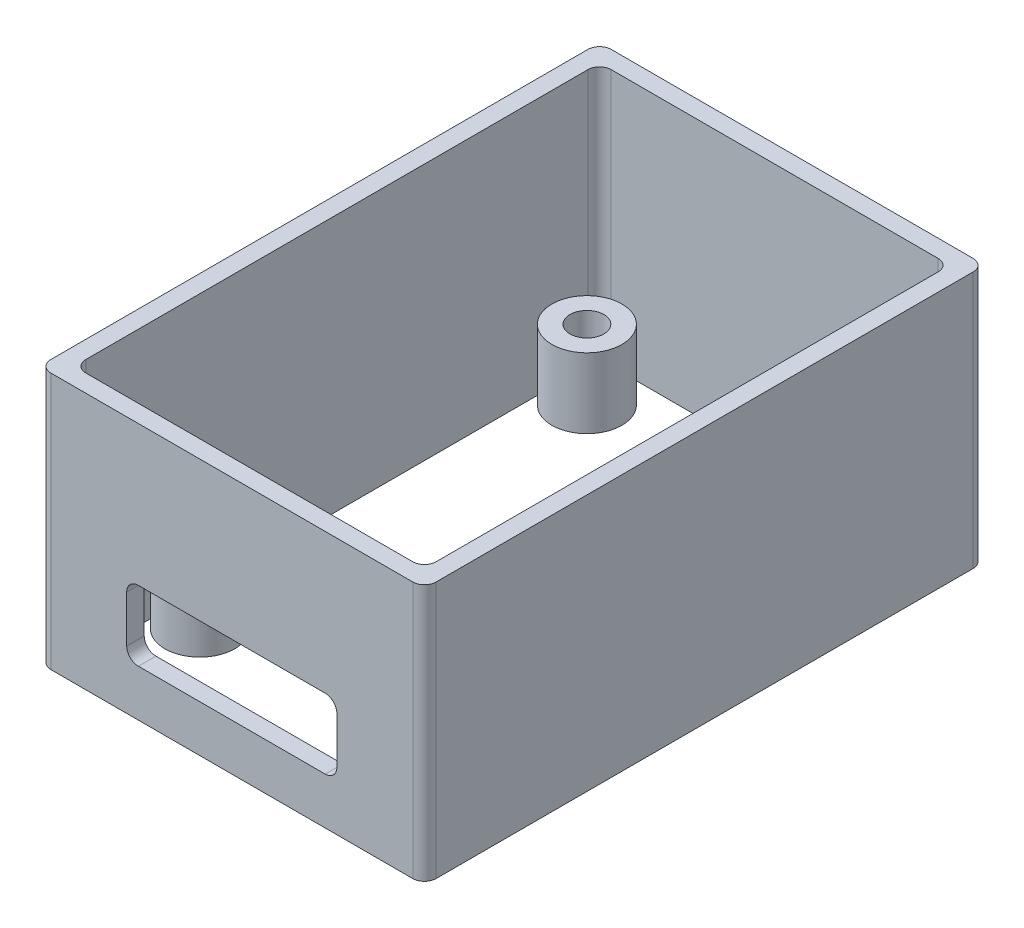
ISO-10303-21;
HEADER;
FILE_DESCRIPTION(('STEP AP214'),'2;1');
FILE_NAME('part.step','',(''),(''),'','','');
FILE_SCHEMA(('AUTOMOTIVE_DESIGN { 1 0 10303 214 1 1 1 1 }'));
ENDSEC;
DATA;
#1=APPLICATION_CONTEXT('core data for automotive mechanical design processes');
#2=APPLICATION_PROTOCOL_DEFINITION('international standard','automotive_design',2000,#1);
#3=PRODUCT_CONTEXT('',#1,'mechanical');
#4=PRODUCT('Part','Part','',(#3));
#5=PRODUCT_RELATED_PRODUCT_CATEGORY('part','',(#4));
#6=PRODUCT_DEFINITION_FORMATION('','',#4);
#7=PRODUCT_DEFINITION_CONTEXT('part definition',#1,'design');
#8=PRODUCT_DEFINITION('design','',#6,#7);
#9=PRODUCT_DEFINITION_SHAPE('','',#8);
#10=(LENGTH_UNIT() NAMED_UNIT(*) SI_UNIT(.MILLI.,.METRE.));
#11=(NAMED_UNIT(*) PLANE_ANGLE_UNIT() SI_UNIT($,.RADIAN.));
#12=(NAMED_UNIT(*) SI_UNIT($,.STERADIAN.) SOLID_ANGLE_UNIT());
#13=UNCERTAINTY_MEASURE_WITH_UNIT(LENGTH_MEASURE(1.E-05),#10,'distance_accuracy_value','');
#14=(GEOMETRIC_REPRESENTATION_CONTEXT(3) GLOBAL_UNCERTAINTY_ASSIGNED_CONTEXT((#13)) GLOBAL_UNIT_ASSIGNED_CONTEXT((#10,
#11,#12)) REPRESENTATION_CONTEXT('',''));
#15=CARTESIAN_POINT('',(0.,0.,0.));
#16=DIRECTION('',(0.,0.,1.));
#17=DIRECTION('',(1.,0.,0.));
#18=AXIS2_PLACEMENT_3D('',#15,#16,#17);
#19=CARTESIAN_POINT('',(-10.16,8.,16.575));
#20=DIRECTION('',(0.,-1.,0.));
#21=DIRECTION('',(0.,0.,-1.));
#22=AXIS2_PLACEMENT_3D('',#19,#20,#21);
#23=CYLINDRICAL_SURFACE('',#22,3.);
#24=CARTESIAN_POINT('',(-10.16,8.,16.575));
#25=DIRECTION('',(0.,1.,0.));
#26=DIRECTION('',(0.,0.,1.));
#27=AXIS2_PLACEMENT_3D('',#24,#25,#26);
#28=CIRCLE('',#27,3.);
#29=CARTESIAN_POINT('',(-10.16,8.,19.575));
#30=VERTEX_POINT('',#29);
#31=EDGE_CURVE('E11',#30,#30,#28,.T.);
#32=ORIENTED_EDGE('',*,*,#31,.F.);
#33=EDGE_LOOP('',(#32));
#34=FACE_BOUND('',#33,.T.);
#35=CARTESIAN_POINT('',(-10.16,2.,16.575));
#36=DIRECTION('',(0.,1.,0.));
#37=DIRECTION('',(0.,0.,1.));
#38=AXIS2_PLACEMENT_3D('',#35,#36,#37);
#39=CIRCLE('',#38,3.);
#40=CARTESIAN_POINT('',(-10.16,2.,19.575));
#41=VERTEX_POINT('',#40);
#42=EDGE_CURVE('E49',#41,#41,#39,.T.);
#43=ORIENTED_EDGE('',*,*,#42,.T.);
#44=EDGE_LOOP('',(#43));
#45=FACE_BOUND('',#44,.T.);
#46=ADVANCED_FACE('F42',(#34,#45),#23,.T.);
#47=CARTESIAN_POINT('',(-10.16,8.,16.575));
#48=DIRECTION('',(0.,1.,0.));
#49=DIRECTION('',(0.,0.,1.));
#50=AXIS2_PLACEMENT_3D('',#47,#48,#49);
#51=PLANE('',#50);
#52=CARTESIAN_POINT('',(-10.16,8.,16.575));
#53=DIRECTION('',(0.,1.,0.));
#54=DIRECTION('',(0.,0.,1.));
#55=AXIS2_PLACEMENT_3D('',#52,#53,#54);
#56=CIRCLE('',#55,1.45);
#57=CARTESIAN_POINT('',(-10.16,8.,18.025));
#58=VERTEX_POINT('',#57);
#59=EDGE_CURVE('E45',#58,#58,#56,.T.);
#60=ORIENTED_EDGE('',*,*,#59,.F.);
#61=EDGE_LOOP('',(#60));
#62=FACE_BOUND('',#61,.T.);
#63=ORIENTED_EDGE('',*,*,#31,.T.);
#64=EDGE_LOOP('',(#63));
#65=FACE_BOUND('',#64,.T.);
#66=ADVANCED_FACE('F65',(#62,#65),#51,.T.);
#67=CARTESIAN_POINT('',(-10.16,2.,16.575));
#68=DIRECTION('',(0.,1.,0.));
#69=DIRECTION('',(0.,0.,1.));
#70=AXIS2_PLACEMENT_3D('',#67,#68,#69);
#71=PLANE('',#70);
#72=CARTESIAN_POINT('',(-10.16,2.,16.575));
#73=DIRECTION('',(0.,1.,0.));
#74=DIRECTION('',(0.,0.,1.));
#75=AXIS2_PLACEMENT_3D('',#72,#73,#74);
#76=CIRCLE('',#75,1.45);
#77=CARTESIAN_POINT('',(-10.16,2.,18.025));
#78=VERTEX_POINT('',#77);
#79=EDGE_CURVE('E54',#78,#78,#76,.T.);
#80=ORIENTED_EDGE('',*,*,#79,.T.);
#81=EDGE_LOOP('',(#80));
#82=FACE_BOUND('',#81,.T.);
#83=ORIENTED_EDGE('',*,*,#42,.F.);
#84=EDGE_LOOP('',(#83));
#85=FACE_BOUND('',#84,.T.);
#86=ADVANCED_FACE('F67',(#82,#85),#71,.F.);
#87=CARTESIAN_POINT('',(-10.16,0.,16.575));
#88=DIRECTION('',(0.,-1.,0.));
#89=DIRECTION('',(0.,0.,-1.));
#90=AXIS2_PLACEMENT_3D('',#87,#88,#89);
#91=CYLINDRICAL_SURFACE('',#90,1.45);
#92=ORIENTED_EDGE('',*,*,#59,.T.);
#93=EDGE_LOOP('',(#92));
#94=FACE_BOUND('',#93,.T.);
#95=ORIENTED_EDGE('',*,*,#79,.F.);
#96=EDGE_LOOP('',(#95));
#97=FACE_BOUND('',#96,.T.);
#98=ADVANCED_FACE('F62',(#94,#97),#91,.F.);
#99=CLOSED_SHELL('',(#46,#66,#86,#98));
#100=MANIFOLD_SOLID_BREP('B2',#99);
#101=CARTESIAN_POINT('',(10.16,8.,-16.575));
#102=DIRECTION('',(0.,-1.,0.));
#103=DIRECTION('',(0.,0.,-1.));
#104=AXIS2_PLACEMENT_3D('',#101,#102,#103);
#105=CYLINDRICAL_SURFACE('',#104,3.);
#106=CARTESIAN_POINT('',(10.16,8.,-16.575));
#107=DIRECTION('',(0.,1.,0.));
#108=DIRECTION('',(0.,0.,1.));
#109=AXIS2_PLACEMENT_3D('',#106,#107,#108);
#110=CIRCLE('',#109,3.);
#111=CARTESIAN_POINT('',(10.16,8.,-13.575));
#112=VERTEX_POINT('',#111);
#113=EDGE_CURVE('E41',#112,#112,#110,.T.);
#114=ORIENTED_EDGE('',*,*,#113,.F.);
#115=EDGE_LOOP('',(#114));
#116=FACE_BOUND('',#115,.T.);
#117=CARTESIAN_POINT('',(10.16,2.,-16.575));
#118=DIRECTION('',(0.,1.,0.));
#119=DIRECTION('',(0.,0.,1.));
#120=AXIS2_PLACEMENT_3D('',#117,#118,#119);
#121=CIRCLE('',#120,3.);
#122=CARTESIAN_POINT('',(10.16,2.,-13.575));
#123=VERTEX_POINT('',#122);
#124=EDGE_CURVE('E119',#123,#123,#121,.T.);
#125=ORIENTED_EDGE('',*,*,#124,.T.);
#126=EDGE_LOOP('',(#125));
#127=FACE_BOUND('',#126,.T.);
#128=ADVANCED_FACE('F112',(#116,#127),#105,.T.);
#129=CARTESIAN_POINT('',(10.16,8.,-16.575));
#130=DIRECTION('',(0.,1.,0.));
#131=DIRECTION('',(0.,0.,1.));
#132=AXIS2_PLACEMENT_3D('',#129,#130,#131);
#133=PLANE('',#132);
#134=CARTESIAN_POINT('',(10.16,8.,-16.575));
#135=DIRECTION('',(0.,1.,0.));
#136=DIRECTION('',(0.,0.,1.));
#137=AXIS2_PLACEMENT_3D('',#134,#135,#136);
#138=CIRCLE('',#137,1.45);
#139=CARTESIAN_POINT('',(10.16,8.,-15.125));
#140=VERTEX_POINT('',#139);
#141=EDGE_CURVE('E124',#140,#140,#138,.T.);
#142=ORIENTED_EDGE('',*,*,#141,.F.);
#143=EDGE_LOOP('',(#142));
#144=FACE_BOUND('',#143,.T.);
#145=ORIENTED_EDGE('',*,*,#113,.T.);
#146=EDGE_LOOP('',(#145));
#147=FACE_BOUND('',#146,.T.);
#148=ADVANCED_FACE('F141',(#144,#147),#133,.T.);
#149=CARTESIAN_POINT('',(10.16,2.,-16.575));
#150=DIRECTION('',(0.,1.,0.));
#151=DIRECTION('',(0.,0.,1.));
#152=AXIS2_PLACEMENT_3D('',#149,#150,#151);
#153=PLANE('',#152);
#154=CARTESIAN_POINT('',(10.16,2.,-16.575));
#155=DIRECTION('',(0.,1.,0.));
#156=DIRECTION('',(0.,0.,1.));
#157=AXIS2_PLACEMENT_3D('',#154,#155,#156);
#158=CIRCLE('',#157,1.45);
#159=CARTESIAN_POINT('',(10.16,2.,-15.125));
#160=VERTEX_POINT('',#159);
#161=EDGE_CURVE('E115',#160,#160,#158,.T.);
#162=ORIENTED_EDGE('',*,*,#161,.T.);
#163=EDGE_LOOP('',(#162));
#164=FACE_BOUND('',#163,.T.);
#165=ORIENTED_EDGE('',*,*,#124,.F.);
#166=EDGE_LOOP('',(#165));
#167=FACE_BOUND('',#166,.T.);
#168=ADVANCED_FACE('F132',(#164,#167),#153,.F.);
#169=CARTESIAN_POINT('',(10.16,0.,-16.575));
#170=DIRECTION('',(0.,-1.,0.));
#171=DIRECTION('',(0.,0.,-1.));
#172=AXIS2_PLACEMENT_3D('',#169,#170,#171);
#173=CYLINDRICAL_SURFACE('',#172,1.45);
#174=ORIENTED_EDGE('',*,*,#141,.T.);
#175=EDGE_LOOP('',(#174));
#176=FACE_BOUND('',#175,.T.);
#177=ORIENTED_EDGE('',*,*,#161,.F.);
#178=EDGE_LOOP('',(#177));
#179=FACE_BOUND('',#178,.T.);
#180=ADVANCED_FACE('F135',(#176,#179),#173,.F.);
#181=CLOSED_SHELL('',(#128,#148,#168,#180));
#182=MANIFOLD_SOLID_BREP('B6',#181);
#183=CARTESIAN_POINT('',(10.16,8.,16.575));
#184=DIRECTION('',(0.,-1.,0.));
#185=DIRECTION('',(0.,0.,-1.));
#186=AXIS2_PLACEMENT_3D('',#183,#184,#185);
#187=CYLINDRICAL_SURFACE('',#186,3.);
#188=CARTESIAN_POINT('',(10.16,8.,16.575));
#189=DIRECTION('',(0.,1.,0.));
#190=DIRECTION('',(0.,0.,1.));
#191=AXIS2_PLACEMENT_3D('',#188,#189,#190);
#192=CIRCLE('',#191,3.);
#193=CARTESIAN_POINT('',(10.16,8.,19.575));
#194=VERTEX_POINT('',#193);
#195=EDGE_CURVE('E111',#194,#194,#192,.T.);
#196=ORIENTED_EDGE('',*,*,#195,.F.);
#197=EDGE_LOOP('',(#196));
#198=FACE_BOUND('',#197,.T.);
#199=CARTESIAN_POINT('',(10.16,2.,16.575));
#200=DIRECTION('',(0.,1.,0.));
#201=DIRECTION('',(0.,0.,1.));
#202=AXIS2_PLACEMENT_3D('',#199,#200,#201);
#203=CIRCLE('',#202,3.);
#204=CARTESIAN_POINT('',(10.16,2.,19.575));
#205=VERTEX_POINT('',#204);
#206=EDGE_CURVE('E189',#205,#205,#203,.T.);
#207=ORIENTED_EDGE('',*,*,#206,.T.);
#208=EDGE_LOOP('',(#207));
#209=FACE_BOUND('',#208,.T.);
#210=ADVANCED_FACE('F182',(#198,#209),#187,.T.);
#211=CARTESIAN_POINT('',(10.16,8.,16.575));
#212=DIRECTION('',(0.,1.,0.));
#213=DIRECTION('',(0.,0.,1.));
#214=AXIS2_PLACEMENT_3D('',#211,#212,#213);
#215=PLANE('',#214);
#216=CARTESIAN_POINT('',(10.16,8.,16.575));
#217=DIRECTION('',(0.,1.,0.));
#218=DIRECTION('',(0.,0.,1.));
#219=AXIS2_PLACEMENT_3D('',#216,#217,#218);
#220=CIRCLE('',#219,1.45);
#221=CARTESIAN_POINT('',(10.16,8.,18.025));
#222=VERTEX_POINT('',#221);
#223=EDGE_CURVE('E194',#222,#222,#220,.T.);
#224=ORIENTED_EDGE('',*,*,#223,.F.);
#225=EDGE_LOOP('',(#224));
#226=FACE_BOUND('',#225,.T.);
#227=ORIENTED_EDGE('',*,*,#195,.T.);
#228=EDGE_LOOP('',(#227));
#229=FACE_BOUND('',#228,.T.);
#230=ADVANCED_FACE('F211',(#226,#229),#215,.T.);
#231=CARTESIAN_POINT('',(10.16,2.,16.575));
#232=DIRECTION('',(0.,1.,0.));
#233=DIRECTION('',(0.,0.,1.));
#234=AXIS2_PLACEMENT_3D('',#231,#232,#233);
#235=PLANE('',#234);
#236=CARTESIAN_POINT('',(10.16,2.,16.575));
#237=DIRECTION('',(0.,1.,0.));
#238=DIRECTION('',(0.,0.,1.));
#239=AXIS2_PLACEMENT_3D('',#236,#237,#238);
#240=CIRCLE('',#239,1.45);
#241=CARTESIAN_POINT('',(10.16,2.,18.025));
#242=VERTEX_POINT('',#241);
#243=EDGE_CURVE('E185',#242,#242,#240,.T.);
#244=ORIENTED_EDGE('',*,*,#243,.T.);
#245=EDGE_LOOP('',(#244));
#246=FACE_BOUND('',#245,.T.);
#247=ORIENTED_EDGE('',*,*,#206,.F.);
#248=EDGE_LOOP('',(#247));
#249=FACE_BOUND('',#248,.T.);
#250=ADVANCED_FACE('F202',(#246,#249),#235,.F.);
#251=CARTESIAN_POINT('',(10.16,0.,16.575));
#252=DIRECTION('',(0.,-1.,0.));
#253=DIRECTION('',(0.,0.,-1.));
#254=AXIS2_PLACEMENT_3D('',#251,#252,#253);
#255=CYLINDRICAL_SURFACE('',#254,1.45);
#256=ORIENTED_EDGE('',*,*,#223,.T.);
#257=EDGE_LOOP('',(#256));
#258=FACE_BOUND('',#257,.T.);
#259=ORIENTED_EDGE('',*,*,#243,.F.);
#260=EDGE_LOOP('',(#259));
#261=FACE_BOUND('',#260,.T.);
#262=ADVANCED_FACE('F205',(#258,#261),#255,.F.);
#263=CLOSED_SHELL('',(#210,#230,#250,#262));
#264=MANIFOLD_SOLID_BREP('B36',#263);
#265=CARTESIAN_POINT('',(-10.16,8.,-16.575));
#266=DIRECTION('',(0.,-1.,0.));
#267=DIRECTION('',(0.,0.,-1.));
#268=AXIS2_PLACEMENT_3D('',#265,#266,#267);
#269=CYLINDRICAL_SURFACE('',#268,3.);
#270=CARTESIAN_POINT('',(-10.16,8.,-16.575));
#271=DIRECTION('',(0.,1.,0.));
#272=DIRECTION('',(0.,0.,1.));
#273=AXIS2_PLACEMENT_3D('',#270,#271,#272);
#274=CIRCLE('',#273,3.);
#275=CARTESIAN_POINT('',(-10.16,8.,-13.575));
#276=VERTEX_POINT('',#275);
#277=EDGE_CURVE('E181',#276,#276,#274,.T.);
#278=ORIENTED_EDGE('',*,*,#277,.F.);
#279=EDGE_LOOP('',(#278));
#280=FACE_BOUND('',#279,.T.);
#281=CARTESIAN_POINT('',(-10.16,2.,-16.575));
#282=DIRECTION('',(0.,1.,0.));
#283=DIRECTION('',(0.,0.,1.));
#284=AXIS2_PLACEMENT_3D('',#281,#282,#283);
#285=CIRCLE('',#284,3.);
#286=CARTESIAN_POINT('',(-10.16,2.,-13.575));
#287=VERTEX_POINT('',#286);
#288=EDGE_CURVE('E260',#287,#287,#285,.T.);
#289=ORIENTED_EDGE('',*,*,#288,.T.);
#290=EDGE_LOOP('',(#289));
#291=FACE_BOUND('',#290,.T.);
#292=ADVANCED_FACE('F253',(#280,#291),#269,.T.);
#293=CARTESIAN_POINT('',(-10.16,8.,-16.575));
#294=DIRECTION('',(0.,1.,0.));
#295=DIRECTION('',(0.,0.,1.));
#296=AXIS2_PLACEMENT_3D('',#293,#294,#295);
#297=PLANE('',#296);
#298=CARTESIAN_POINT('',(-10.16,8.,-16.575));
#299=DIRECTION('',(0.,1.,0.));
#300=DIRECTION('',(0.,0.,1.));
#301=AXIS2_PLACEMENT_3D('',#298,#299,#300);
#302=CIRCLE('',#301,1.45);
#303=CARTESIAN_POINT('',(-10.16,8.,-15.125));
#304=VERTEX_POINT('',#303);
#305=EDGE_CURVE('E265',#304,#304,#302,.T.);
#306=ORIENTED_EDGE('',*,*,#305,.F.);
#307=EDGE_LOOP('',(#306));
#308=FACE_BOUND('',#307,.T.);
#309=ORIENTED_EDGE('',*,*,#277,.T.);
#310=EDGE_LOOP('',(#309));
#311=FACE_BOUND('',#310,.T.);
#312=ADVANCED_FACE('F282',(#308,#311),#297,.T.);
#313=CARTESIAN_POINT('',(-10.16,2.,-16.575));
#314=DIRECTION('',(0.,1.,0.));
#315=DIRECTION('',(0.,0.,1.));
#316=AXIS2_PLACEMENT_3D('',#313,#314,#315);
#317=PLANE('',#316);
#318=CARTESIAN_POINT('',(-10.16,2.,-16.575));
#319=DIRECTION('',(0.,1.,0.));
#320=DIRECTION('',(0.,0.,1.));
#321=AXIS2_PLACEMENT_3D('',#318,#319,#320);
#322=CIRCLE('',#321,1.45);
#323=CARTESIAN_POINT('',(-10.16,2.,-15.125));
#324=VERTEX_POINT('',#323);
#325=EDGE_CURVE('E256',#324,#324,#322,.T.);
#326=ORIENTED_EDGE('',*,*,#325,.T.);
#327=EDGE_LOOP('',(#326));
#328=FACE_BOUND('',#327,.T.);
#329=ORIENTED_EDGE('',*,*,#288,.F.);
#330=EDGE_LOOP('',(#329));
#331=FACE_BOUND('',#330,.T.);
#332=ADVANCED_FACE('F273',(#328,#331),#317,.F.);
#333=CARTESIAN_POINT('',(-10.16,0.,-16.575));
#334=DIRECTION('',(0.,-1.,0.));
#335=DIRECTION('',(0.,0.,-1.));
#336=AXIS2_PLACEMENT_3D('',#333,#334,#335);
#337=CYLINDRICAL_SURFACE('',#336,1.45);
#338=ORIENTED_EDGE('',*,*,#305,.T.);
#339=EDGE_LOOP('',(#338));
#340=FACE_BOUND('',#339,.T.);
#341=ORIENTED_EDGE('',*,*,#325,.F.);
#342=EDGE_LOOP('',(#341));
#343=FACE_BOUND('',#342,.T.);
#344=ADVANCED_FACE('F276',(#340,#343),#337,.F.);
#345=CLOSED_SHELL('',(#292,#312,#332,#344));
#346=MANIFOLD_SOLID_BREP('B106',#345);
#347=CARTESIAN_POINT('',(-16.5,22.,-24.));
#348=DIRECTION('',(0.,0.,-1.));
#349=DIRECTION('',(-1.,0.,0.));
#350=AXIS2_PLACEMENT_3D('',#347,#348,#349);
#351=PLANE('',#350);
#352=DIRECTION('',(1.,0.,0.));
#353=VECTOR('',#352,1.);
#354=CARTESIAN_POINT('',(-16.5,22.,-24.));
#355=LINE('',#354,#353);
#356=CARTESIAN_POINT('',(-15.5,22.,-24.));
#357=VERTEX_POINT('',#356);
#358=CARTESIAN_POINT('',(15.5,22.,-24.));
#359=VERTEX_POINT('',#358);
#360=EDGE_CURVE('E650',#357,#359,#355,.T.);
#361=ORIENTED_EDGE('',*,*,#360,.T.);
#362=DIRECTION('',(0.,-1.,0.));
#363=VECTOR('',#362,1.);
#364=CARTESIAN_POINT('',(15.5,22.,-24.));
#365=LINE('',#364,#363);
#366=CARTESIAN_POINT('',(15.5,0.,-24.));
#367=VERTEX_POINT('',#366);
#368=EDGE_CURVE('E496',#359,#367,#365,.T.);
#369=ORIENTED_EDGE('',*,*,#368,.T.);
#370=DIRECTION('',(1.,0.,0.));
#371=VECTOR('',#370,1.);
#372=CARTESIAN_POINT('',(-16.5,0.,-24.));
#373=LINE('',#372,#371);
#374=CARTESIAN_POINT('',(-15.5,0.,-24.));
#375=VERTEX_POINT('',#374);
#376=EDGE_CURVE('E480',#375,#367,#373,.T.);
#377=ORIENTED_EDGE('',*,*,#376,.F.);
#378=DIRECTION('',(0.,-1.,0.));
#379=VECTOR('',#378,1.);
#380=CARTESIAN_POINT('',(-15.5,22.,-24.));
#381=LINE('',#380,#379);
#382=EDGE_CURVE('E493',#375,#357,#381,.F.);
#383=ORIENTED_EDGE('',*,*,#382,.T.);
#384=EDGE_LOOP('',(#361,#369,#377,#383));
#385=FACE_BOUND('',#384,.T.);
#386=ADVANCED_FACE('F315',(#385),#351,.T.);
#387=CARTESIAN_POINT('',(-16.5,22.,-24.));
#388=DIRECTION('',(1.,0.,0.));
#389=DIRECTION('',(0.,0.,-1.));
#390=AXIS2_PLACEMENT_3D('',#387,#388,#389);
#391=PLANE('',#390);
#392=DIRECTION('',(0.,0.,1.));
#393=VECTOR('',#392,1.);
#394=CARTESIAN_POINT('',(-16.5,22.,-24.));
#395=LINE('',#394,#393);
#396=CARTESIAN_POINT('',(-16.5,22.,-23.));
#397=VERTEX_POINT('',#396);
#398=CARTESIAN_POINT('',(-16.5,22.,23.));
#399=VERTEX_POINT('',#398);
#400=EDGE_CURVE('E658',#397,#399,#395,.T.);
#401=ORIENTED_EDGE('',*,*,#400,.F.);
#402=DIRECTION('',(0.,-1.,0.));
#403=VECTOR('',#402,1.);
#404=CARTESIAN_POINT('',(-16.5,0.,-23.));
#405=LINE('',#404,#403);
#406=CARTESIAN_POINT('',(-16.5,0.,-23.));
#407=VERTEX_POINT('',#406);
#408=EDGE_CURVE('E539',#397,#407,#405,.T.);
#409=ORIENTED_EDGE('',*,*,#408,.T.);
#410=DIRECTION('',(0.,0.,1.));
#411=VECTOR('',#410,1.);
#412=CARTESIAN_POINT('',(-16.5,0.,-24.));
#413=LINE('',#412,#411);
#414=CARTESIAN_POINT('',(-16.5,0.,23.));
#415=VERTEX_POINT('',#414);
#416=EDGE_CURVE('E482',#407,#415,#413,.T.);
#417=ORIENTED_EDGE('',*,*,#416,.T.);
#418=DIRECTION('',(0.,-1.,0.));
#419=VECTOR('',#418,1.);
#420=CARTESIAN_POINT('',(-16.5,22.,23.));
#421=LINE('',#420,#419);
#422=EDGE_CURVE('E537',#415,#399,#421,.F.);
#423=ORIENTED_EDGE('',*,*,#422,.T.);
#424=EDGE_LOOP('',(#401,#409,#417,#423));
#425=FACE_BOUND('',#424,.T.);
#426=ADVANCED_FACE('F722',(#425),#391,.F.);
#427=CARTESIAN_POINT('',(-16.5,22.,24.));
#428=DIRECTION('',(0.,0.,-1.));
#429=DIRECTION('',(-1.,0.,0.));
#430=AXIS2_PLACEMENT_3D('',#427,#428,#429);
#431=PLANE('',#430);
#432=DIRECTION('',(-1.,0.,0.));
#433=VECTOR('',#432,1.);
#434=CARTESIAN_POINT('',(9.,10.,24.));
#435=LINE('',#434,#433);
#436=CARTESIAN_POINT('',(8.,10.,24.));
#437=VERTEX_POINT('',#436);
#438=CARTESIAN_POINT('',(-8.,10.,24.));
#439=VERTEX_POINT('',#438);
#440=EDGE_CURVE('E614',#437,#439,#435,.T.);
#441=ORIENTED_EDGE('',*,*,#440,.F.);
#442=CARTESIAN_POINT('',(8.,9.,24.));
#443=DIRECTION('',(0.,0.,-1.));
#444=DIRECTION('',(-1.,0.,0.));
#445=AXIS2_PLACEMENT_3D('',#442,#443,#444);
#446=CIRCLE('',#445,1.);
#447=CARTESIAN_POINT('',(9.,9.,24.));
#448=VERTEX_POINT('',#447);
#449=EDGE_CURVE('E595',#437,#448,#446,.T.);
#450=ORIENTED_EDGE('',*,*,#449,.T.);
#451=DIRECTION('',(0.,1.,0.));
#452=VECTOR('',#451,1.);
#453=CARTESIAN_POINT('',(9.,4.,24.));
#454=LINE('',#453,#452);
#455=CARTESIAN_POINT('',(9.,5.,24.));
#456=VERTEX_POINT('',#455);
#457=EDGE_CURVE('E636',#456,#448,#454,.T.);
#458=ORIENTED_EDGE('',*,*,#457,.F.);
#459=CARTESIAN_POINT('',(8.,5.,24.));
#460=DIRECTION('',(0.,0.,-1.));
#461=DIRECTION('',(-1.,0.,0.));
#462=AXIS2_PLACEMENT_3D('',#459,#460,#461);
#463=CIRCLE('',#462,1.);
#464=CARTESIAN_POINT('',(8.,4.,24.));
#465=VERTEX_POINT('',#464);
#466=EDGE_CURVE('E591',#456,#465,#463,.T.);
#467=ORIENTED_EDGE('',*,*,#466,.T.);
#468=DIRECTION('',(1.,0.,0.));
#469=VECTOR('',#468,1.);
#470=CARTESIAN_POINT('',(9.,4.,24.));
#471=LINE('',#470,#469);
#472=CARTESIAN_POINT('',(-8.,4.,24.));
#473=VERTEX_POINT('',#472);
#474=EDGE_CURVE('E609',#473,#465,#471,.T.);
#475=ORIENTED_EDGE('',*,*,#474,.F.);
#476=CARTESIAN_POINT('',(-8.,5.,24.));
#477=DIRECTION('',(0.,0.,-1.));
#478=DIRECTION('',(-1.,0.,0.));
#479=AXIS2_PLACEMENT_3D('',#476,#477,#478);
#480=CIRCLE('',#479,1.);
#481=CARTESIAN_POINT('',(-9.,5.,24.));
#482=VERTEX_POINT('',#481);
#483=EDGE_CURVE('E323',#473,#482,#480,.T.);
#484=ORIENTED_EDGE('',*,*,#483,.T.);
#485=DIRECTION('',(0.,-1.,0.));
#486=VECTOR('',#485,1.);
#487=CARTESIAN_POINT('',(-9.,4.,24.));
#488=LINE('',#487,#486);
#489=CARTESIAN_POINT('',(-9.,9.,24.));
#490=VERTEX_POINT('',#489);
#491=EDGE_CURVE('E607',#490,#482,#488,.T.);
#492=ORIENTED_EDGE('',*,*,#491,.F.);
#493=CARTESIAN_POINT('',(-8.,9.,24.));
#494=DIRECTION('',(0.,0.,-1.));
#495=DIRECTION('',(-1.,0.,0.));
#496=AXIS2_PLACEMENT_3D('',#493,#494,#495);
#497=CIRCLE('',#496,1.);
#498=EDGE_CURVE('E599',#490,#439,#497,.T.);
#499=ORIENTED_EDGE('',*,*,#498,.T.);
#500=EDGE_LOOP('',(#441,#450,#458,#467,#475,#484,#492,#499));
#501=FACE_BOUND('',#500,.T.);
#502=DIRECTION('',(1.,0.,0.));
#503=VECTOR('',#502,1.);
#504=CARTESIAN_POINT('',(-16.5,22.,24.));
#505=LINE('',#504,#503);
#506=CARTESIAN_POINT('',(-15.5,22.,24.));
#507=VERTEX_POINT('',#506);
#508=CARTESIAN_POINT('',(15.5,22.,24.));
#509=VERTEX_POINT('',#508);
#510=EDGE_CURVE('E655',#507,#509,#505,.T.);
#511=ORIENTED_EDGE('',*,*,#510,.F.);
#512=DIRECTION('',(0.,-1.,0.));
#513=VECTOR('',#512,1.);
#514=CARTESIAN_POINT('',(-15.5,22.,24.));
#515=LINE('',#514,#513);
#516=CARTESIAN_POINT('',(-15.5,0.,24.));
#517=VERTEX_POINT('',#516);
#518=EDGE_CURVE('E548',#507,#517,#515,.T.);
#519=ORIENTED_EDGE('',*,*,#518,.T.);
#520=DIRECTION('',(1.,0.,0.));
#521=VECTOR('',#520,1.);
#522=CARTESIAN_POINT('',(-16.5,0.,24.));
#523=LINE('',#522,#521);
#524=CARTESIAN_POINT('',(15.5,0.,24.));
#525=VERTEX_POINT('',#524);
#526=EDGE_CURVE('E664',#517,#525,#523,.T.);
#527=ORIENTED_EDGE('',*,*,#526,.T.);
#528=DIRECTION('',(0.,-1.,0.));
#529=VECTOR('',#528,1.);
#530=CARTESIAN_POINT('',(15.5,22.,24.));
#531=LINE('',#530,#529);
#532=EDGE_CURVE('E546',#525,#509,#531,.F.);
#533=ORIENTED_EDGE('',*,*,#532,.T.);
#534=EDGE_LOOP('',(#511,#519,#527,#533));
#535=FACE_BOUND('',#534,.T.);
#536=ADVANCED_FACE('F605',(#501,#535),#431,.F.);
#537=CARTESIAN_POINT('',(16.5,22.,-24.));
#538=DIRECTION('',(1.,0.,0.));
#539=DIRECTION('',(0.,0.,-1.));
#540=AXIS2_PLACEMENT_3D('',#537,#538,#539);
#541=PLANE('',#540);
#542=DIRECTION('',(0.,0.,1.));
#543=VECTOR('',#542,1.);
#544=CARTESIAN_POINT('',(16.5,0.,-24.));
#545=LINE('',#544,#543);
#546=CARTESIAN_POINT('',(16.5,0.,-23.));
#547=VERTEX_POINT('',#546);
#548=CARTESIAN_POINT('',(16.5,0.,23.));
#549=VERTEX_POINT('',#548);
#550=EDGE_CURVE('E497',#547,#549,#545,.T.);
#551=ORIENTED_EDGE('',*,*,#550,.F.);
#552=DIRECTION('',(0.,-1.,0.));
#553=VECTOR('',#552,1.);
#554=CARTESIAN_POINT('',(16.5,22.,-23.));
#555=LINE('',#554,#553);
#556=CARTESIAN_POINT('',(16.5,22.,-23.));
#557=VERTEX_POINT('',#556);
#558=EDGE_CURVE('E518',#547,#557,#555,.F.);
#559=ORIENTED_EDGE('',*,*,#558,.T.);
#560=DIRECTION('',(0.,0.,1.));
#561=VECTOR('',#560,1.);
#562=CARTESIAN_POINT('',(16.5,22.,-24.));
#563=LINE('',#562,#561);
#564=CARTESIAN_POINT('',(16.5,22.,23.));
#565=VERTEX_POINT('',#564);
#566=EDGE_CURVE('E652',#557,#565,#563,.T.);
#567=ORIENTED_EDGE('',*,*,#566,.T.);
#568=DIRECTION('',(0.,-1.,0.));
#569=VECTOR('',#568,1.);
#570=CARTESIAN_POINT('',(16.5,0.,23.));
#571=LINE('',#570,#569);
#572=EDGE_CURVE('E515',#565,#549,#571,.T.);
#573=ORIENTED_EDGE('',*,*,#572,.T.);
#574=EDGE_LOOP('',(#551,#559,#567,#573));
#575=FACE_BOUND('',#574,.T.);
#576=ADVANCED_FACE('F718',(#575),#541,.T.);
#577=CARTESIAN_POINT('',(0.,22.,0.));
#578=DIRECTION('',(0.,-1.,0.));
#579=DIRECTION('',(0.,0.,-1.));
#580=AXIS2_PLACEMENT_3D('',#577,#578,#579);
#581=PLANE('',#580);
#582=DIRECTION('',(-1.,0.,0.));
#583=VECTOR('',#582,1.);
#584=CARTESIAN_POINT('',(-15.,22.,-22.5));
#585=LINE('',#584,#583);
#586=CARTESIAN_POINT('',(14.,22.,-22.5));
#587=VERTEX_POINT('',#586);
#588=CARTESIAN_POINT('',(-14.,22.,-22.5));
#589=VERTEX_POINT('',#588);
#590=EDGE_CURVE('E630',#587,#589,#585,.T.);
#591=ORIENTED_EDGE('',*,*,#590,.F.);
#592=CARTESIAN_POINT('',(14.,22.,-21.5));
#593=DIRECTION('',(0.,-1.,0.));
#594=DIRECTION('',(0.,0.,-1.));
#595=AXIS2_PLACEMENT_3D('',#592,#593,#594);
#596=CIRCLE('',#595,1.);
#597=CARTESIAN_POINT('',(15.,22.,-21.5));
#598=VERTEX_POINT('',#597);
#599=EDGE_CURVE('E556',#587,#598,#596,.T.);
#600=ORIENTED_EDGE('',*,*,#599,.T.);
#601=DIRECTION('',(0.,0.,-1.));
#602=VECTOR('',#601,1.);
#603=CARTESIAN_POINT('',(15.,22.,-22.5));
#604=LINE('',#603,#602);
#605=CARTESIAN_POINT('',(15.,22.,21.5));
#606=VERTEX_POINT('',#605);
#607=EDGE_CURVE('E627',#606,#598,#604,.T.);
#608=ORIENTED_EDGE('',*,*,#607,.F.);
#609=CARTESIAN_POINT('',(14.,22.,21.5));
#610=DIRECTION('',(0.,-1.,0.));
#611=DIRECTION('',(0.,0.,-1.));
#612=AXIS2_PLACEMENT_3D('',#609,#610,#611);
#613=CIRCLE('',#612,1.);
#614=CARTESIAN_POINT('',(14.,22.,22.5));
#615=VERTEX_POINT('',#614);
#616=EDGE_CURVE('E568',#606,#615,#613,.T.);
#617=ORIENTED_EDGE('',*,*,#616,.T.);
#618=DIRECTION('',(1.,0.,0.));
#619=VECTOR('',#618,1.);
#620=CARTESIAN_POINT('',(-15.,22.,22.5));
#621=LINE('',#620,#619);
#622=CARTESIAN_POINT('',(-14.,22.,22.5));
#623=VERTEX_POINT('',#622);
#624=EDGE_CURVE('E498',#623,#615,#621,.T.);
#625=ORIENTED_EDGE('',*,*,#624,.F.);
#626=CARTESIAN_POINT('',(-14.,22.,21.5));
#627=DIRECTION('',(0.,-1.,0.));
#628=DIRECTION('',(0.,0.,-1.));
#629=AXIS2_PLACEMENT_3D('',#626,#627,#628);
#630=CIRCLE('',#629,1.);
#631=CARTESIAN_POINT('',(-15.,22.,21.5));
#632=VERTEX_POINT('',#631);
#633=EDGE_CURVE('E564',#623,#632,#630,.T.);
#634=ORIENTED_EDGE('',*,*,#633,.T.);
#635=DIRECTION('',(0.,0.,1.));
#636=VECTOR('',#635,1.);
#637=CARTESIAN_POINT('',(-15.,22.,-22.5));
#638=LINE('',#637,#636);
#639=CARTESIAN_POINT('',(-15.,22.,-21.5));
#640=VERTEX_POINT('',#639);
#641=EDGE_CURVE('E645',#640,#632,#638,.T.);
#642=ORIENTED_EDGE('',*,*,#641,.F.);
#643=CARTESIAN_POINT('',(-14.,22.,-21.5));
#644=DIRECTION('',(0.,-1.,0.));
#645=DIRECTION('',(0.,0.,-1.));
#646=AXIS2_PLACEMENT_3D('',#643,#644,#645);
#647=CIRCLE('',#646,1.);
#648=EDGE_CURVE('E560',#640,#589,#647,.T.);
#649=ORIENTED_EDGE('',*,*,#648,.T.);
#650=EDGE_LOOP('',(#591,#600,#608,#617,#625,#634,#642,#649));
#651=FACE_BOUND('',#650,.T.);
#652=ORIENTED_EDGE('',*,*,#566,.F.);
#653=CARTESIAN_POINT('',(15.5,22.,-23.));
#654=DIRECTION('',(0.,-1.,0.));
#655=DIRECTION('',(0.,0.,-1.));
#656=AXIS2_PLACEMENT_3D('',#653,#654,#655);
#657=CIRCLE('',#656,1.);
#658=EDGE_CURVE('E525',#557,#359,#657,.F.);
#659=ORIENTED_EDGE('',*,*,#658,.T.);
#660=ORIENTED_EDGE('',*,*,#360,.F.);
#661=CARTESIAN_POINT('',(-15.5,22.,-23.));
#662=DIRECTION('',(0.,-1.,0.));
#663=DIRECTION('',(0.,0.,-1.));
#664=AXIS2_PLACEMENT_3D('',#661,#662,#663);
#665=CIRCLE('',#664,1.);
#666=EDGE_CURVE('E502',#357,#397,#665,.F.);
#667=ORIENTED_EDGE('',*,*,#666,.T.);
#668=ORIENTED_EDGE('',*,*,#400,.T.);
#669=CARTESIAN_POINT('',(-15.5,22.,23.));
#670=DIRECTION('',(0.,-1.,0.));
#671=DIRECTION('',(0.,0.,-1.));
#672=AXIS2_PLACEMENT_3D('',#669,#670,#671);
#673=CIRCLE('',#672,1.);
#674=EDGE_CURVE('E522',#399,#507,#673,.F.);
#675=ORIENTED_EDGE('',*,*,#674,.T.);
#676=ORIENTED_EDGE('',*,*,#510,.T.);
#677=CARTESIAN_POINT('',(15.5,22.,23.));
#678=DIRECTION('',(0.,-1.,0.));
#679=DIRECTION('',(0.,0.,-1.));
#680=AXIS2_PLACEMENT_3D('',#677,#678,#679);
#681=CIRCLE('',#680,1.);
#682=EDGE_CURVE('E520',#509,#565,#681,.F.);
#683=ORIENTED_EDGE('',*,*,#682,.T.);
#684=EDGE_LOOP('',(#652,#659,#660,#667,#668,#675,#676,#683));
#685=FACE_BOUND('',#684,.T.);
#686=ADVANCED_FACE('F686',(#651,#685),#581,.F.);
#687=CARTESIAN_POINT('',(0.,0.,0.));
#688=DIRECTION('',(0.,-1.,0.));
#689=DIRECTION('',(0.,0.,-1.));
#690=AXIS2_PLACEMENT_3D('',#687,#688,#689);
#691=PLANE('',#690);
#692=DIRECTION('',(0.,0.,1.));
#693=VECTOR('',#692,1.);
#694=CARTESIAN_POINT('',(15.,0.,0.));
#695=LINE('',#694,#693);
#696=CARTESIAN_POINT('',(15.,0.,-21.5));
#697=VERTEX_POINT('',#696);
#698=CARTESIAN_POINT('',(15.,0.,21.5));
#699=VERTEX_POINT('',#698);
#700=EDGE_CURVE('E503',#697,#699,#695,.T.);
#701=ORIENTED_EDGE('',*,*,#700,.F.);
#702=CARTESIAN_POINT('',(14.,0.,-21.5));
#703=DIRECTION('',(0.,-1.,0.));
#704=DIRECTION('',(0.,0.,-1.));
#705=AXIS2_PLACEMENT_3D('',#702,#703,#704);
#706=CIRCLE('',#705,1.);
#707=CARTESIAN_POINT('',(14.,0.,-22.5));
#708=VERTEX_POINT('',#707);
#709=EDGE_CURVE('E558',#697,#708,#706,.F.);
#710=ORIENTED_EDGE('',*,*,#709,.T.);
#711=DIRECTION('',(1.,0.,0.));
#712=VECTOR('',#711,1.);
#713=CARTESIAN_POINT('',(0.,0.,-22.5));
#714=LINE('',#713,#712);
#715=CARTESIAN_POINT('',(-14.,0.,-22.5));
#716=VERTEX_POINT('',#715);
#717=EDGE_CURVE('E660',#716,#708,#714,.T.);
#718=ORIENTED_EDGE('',*,*,#717,.F.);
#719=CARTESIAN_POINT('',(-14.,0.,-21.5));
#720=DIRECTION('',(0.,-1.,0.));
#721=DIRECTION('',(0.,0.,-1.));
#722=AXIS2_PLACEMENT_3D('',#719,#720,#721);
#723=CIRCLE('',#722,1.);
#724=CARTESIAN_POINT('',(-15.,0.,-21.5));
#725=VERTEX_POINT('',#724);
#726=EDGE_CURVE('E562',#716,#725,#723,.F.);
#727=ORIENTED_EDGE('',*,*,#726,.T.);
#728=DIRECTION('',(0.,0.,-1.));
#729=VECTOR('',#728,1.);
#730=CARTESIAN_POINT('',(-15.,0.,0.));
#731=LINE('',#730,#729);
#732=CARTESIAN_POINT('',(-15.,0.,21.5));
#733=VERTEX_POINT('',#732);
#734=EDGE_CURVE('E670',#733,#725,#731,.T.);
#735=ORIENTED_EDGE('',*,*,#734,.F.);
#736=CARTESIAN_POINT('',(-14.,0.,21.5));
#737=DIRECTION('',(0.,-1.,0.));
#738=DIRECTION('',(0.,0.,-1.));
#739=AXIS2_PLACEMENT_3D('',#736,#737,#738);
#740=CIRCLE('',#739,1.);
#741=CARTESIAN_POINT('',(-14.,0.,22.5));
#742=VERTEX_POINT('',#741);
#743=EDGE_CURVE('E566',#733,#742,#740,.F.);
#744=ORIENTED_EDGE('',*,*,#743,.T.);
#745=DIRECTION('',(-1.,0.,0.));
#746=VECTOR('',#745,1.);
#747=CARTESIAN_POINT('',(0.,0.,22.5));
#748=LINE('',#747,#746);
#749=CARTESIAN_POINT('',(14.,0.,22.5));
#750=VERTEX_POINT('',#749);
#751=EDGE_CURVE('E508',#750,#742,#748,.T.);
#752=ORIENTED_EDGE('',*,*,#751,.F.);
#753=CARTESIAN_POINT('',(14.,0.,21.5));
#754=DIRECTION('',(0.,-1.,0.));
#755=DIRECTION('',(0.,0.,-1.));
#756=AXIS2_PLACEMENT_3D('',#753,#754,#755);
#757=CIRCLE('',#756,1.);
#758=EDGE_CURVE('E570',#750,#699,#757,.F.);
#759=ORIENTED_EDGE('',*,*,#758,.T.);
#760=EDGE_LOOP('',(#701,#710,#718,#727,#735,#744,#752,#759));
#761=FACE_BOUND('',#760,.T.);
#762=ORIENTED_EDGE('',*,*,#376,.T.);
#763=CARTESIAN_POINT('',(15.5,0.,-23.));
#764=DIRECTION('',(0.,-1.,0.));
#765=DIRECTION('',(0.,0.,-1.));
#766=AXIS2_PLACEMENT_3D('',#763,#764,#765);
#767=CIRCLE('',#766,1.);
#768=EDGE_CURVE('E487',#367,#547,#767,.T.);
#769=ORIENTED_EDGE('',*,*,#768,.T.);
#770=ORIENTED_EDGE('',*,*,#550,.T.);
#771=CARTESIAN_POINT('',(15.5,0.,23.));
#772=DIRECTION('',(0.,-1.,0.));
#773=DIRECTION('',(0.,0.,-1.));
#774=AXIS2_PLACEMENT_3D('',#771,#772,#773);
#775=CIRCLE('',#774,1.);
#776=EDGE_CURVE('E505',#549,#525,#775,.T.);
#777=ORIENTED_EDGE('',*,*,#776,.T.);
#778=ORIENTED_EDGE('',*,*,#526,.F.);
#779=CARTESIAN_POINT('',(-15.5,0.,23.));
#780=DIRECTION('',(0.,-1.,0.));
#781=DIRECTION('',(0.,0.,-1.));
#782=AXIS2_PLACEMENT_3D('',#779,#780,#781);
#783=CIRCLE('',#782,1.);
#784=EDGE_CURVE('E488',#517,#415,#783,.T.);
#785=ORIENTED_EDGE('',*,*,#784,.T.);
#786=ORIENTED_EDGE('',*,*,#416,.F.);
#787=CARTESIAN_POINT('',(-15.5,0.,-23.));
#788=DIRECTION('',(0.,-1.,0.));
#789=DIRECTION('',(0.,0.,-1.));
#790=AXIS2_PLACEMENT_3D('',#787,#788,#789);
#791=CIRCLE('',#790,1.);
#792=EDGE_CURVE('E477',#407,#375,#791,.T.);
#793=ORIENTED_EDGE('',*,*,#792,.T.);
#794=EDGE_LOOP('',(#762,#769,#770,#777,#778,#785,#786,#793));
#795=FACE_BOUND('',#794,.T.);
#796=ADVANCED_FACE('F479',(#761,#795),#691,.T.);
#797=CARTESIAN_POINT('',(15.,-3.,-22.5));
#798=DIRECTION('',(1.,0.,0.));
#799=DIRECTION('',(0.,0.,-1.));
#800=AXIS2_PLACEMENT_3D('',#797,#798,#799);
#801=PLANE('',#800);
#802=ORIENTED_EDGE('',*,*,#607,.T.);
#803=DIRECTION('',(0.,1.,0.));
#804=VECTOR('',#803,1.);
#805=CARTESIAN_POINT('',(15.,0.,-21.5));
#806=LINE('',#805,#804);
#807=EDGE_CURVE('E535',#598,#697,#806,.F.);
#808=ORIENTED_EDGE('',*,*,#807,.T.);
#809=ORIENTED_EDGE('',*,*,#700,.T.);
#810=DIRECTION('',(0.,1.,0.));
#811=VECTOR('',#810,1.);
#812=CARTESIAN_POINT('',(15.,22.,21.5));
#813=LINE('',#812,#811);
#814=EDGE_CURVE('E532',#699,#606,#813,.T.);
#815=ORIENTED_EDGE('',*,*,#814,.T.);
#816=EDGE_LOOP('',(#802,#808,#809,#815));
#817=FACE_BOUND('',#816,.T.);
#818=ADVANCED_FACE('F706',(#817),#801,.F.);
#819=CARTESIAN_POINT('',(-15.,-3.,22.5));
#820=DIRECTION('',(0.,0.,1.));
#821=DIRECTION('',(1.,0.,0.));
#822=AXIS2_PLACEMENT_3D('',#819,#820,#821);
#823=PLANE('',#822);
#824=DIRECTION('',(0.,-1.,0.));
#825=VECTOR('',#824,1.);
#826=CARTESIAN_POINT('',(-9.,4.,22.5));
#827=LINE('',#826,#825);
#828=CARTESIAN_POINT('',(-9.,9.,22.5));
#829=VERTEX_POINT('',#828);
#830=CARTESIAN_POINT('',(-9.,5.,22.5));
#831=VERTEX_POINT('',#830);
#832=EDGE_CURVE('E623',#829,#831,#827,.T.);
#833=ORIENTED_EDGE('',*,*,#832,.T.);
#834=CARTESIAN_POINT('',(-8.,5.,22.5));
#835=DIRECTION('',(0.,0.,1.));
#836=DIRECTION('',(1.,0.,0.));
#837=AXIS2_PLACEMENT_3D('',#834,#835,#836);
#838=CIRCLE('',#837,1.);
#839=CARTESIAN_POINT('',(-8.,4.,22.5));
#840=VERTEX_POINT('',#839);
#841=EDGE_CURVE('E251',#831,#840,#838,.T.);
#842=ORIENTED_EDGE('',*,*,#841,.T.);
#843=DIRECTION('',(1.,0.,0.));
#844=VECTOR('',#843,1.);
#845=CARTESIAN_POINT('',(9.,4.,22.5));
#846=LINE('',#845,#844);
#847=CARTESIAN_POINT('',(8.,4.,22.5));
#848=VERTEX_POINT('',#847);
#849=EDGE_CURVE('E621',#840,#848,#846,.T.);
#850=ORIENTED_EDGE('',*,*,#849,.T.);
#851=CARTESIAN_POINT('',(8.,5.,22.5));
#852=DIRECTION('',(0.,0.,1.));
#853=DIRECTION('',(1.,0.,0.));
#854=AXIS2_PLACEMENT_3D('',#851,#852,#853);
#855=CIRCLE('',#854,1.);
#856=CARTESIAN_POINT('',(9.,5.,22.5));
#857=VERTEX_POINT('',#856);
#858=EDGE_CURVE('E593',#848,#857,#855,.T.);
#859=ORIENTED_EDGE('',*,*,#858,.T.);
#860=DIRECTION('',(0.,1.,0.));
#861=VECTOR('',#860,1.);
#862=CARTESIAN_POINT('',(9.,4.,22.5));
#863=LINE('',#862,#861);
#864=CARTESIAN_POINT('',(9.,9.,22.5));
#865=VERTEX_POINT('',#864);
#866=EDGE_CURVE('E641',#857,#865,#863,.T.);
#867=ORIENTED_EDGE('',*,*,#866,.T.);
#868=CARTESIAN_POINT('',(8.,9.,22.5));
#869=DIRECTION('',(0.,0.,1.));
#870=DIRECTION('',(1.,0.,0.));
#871=AXIS2_PLACEMENT_3D('',#868,#869,#870);
#872=CIRCLE('',#871,1.);
#873=CARTESIAN_POINT('',(8.,10.,22.5));
#874=VERTEX_POINT('',#873);
#875=EDGE_CURVE('E597',#865,#874,#872,.T.);
#876=ORIENTED_EDGE('',*,*,#875,.T.);
#877=DIRECTION('',(-1.,0.,0.));
#878=VECTOR('',#877,1.);
#879=CARTESIAN_POINT('',(9.,10.,22.5));
#880=LINE('',#879,#878);
#881=CARTESIAN_POINT('',(-8.,10.,22.5));
#882=VERTEX_POINT('',#881);
#883=EDGE_CURVE('E632',#874,#882,#880,.T.);
#884=ORIENTED_EDGE('',*,*,#883,.T.);
#885=CARTESIAN_POINT('',(-8.,9.,22.5));
#886=DIRECTION('',(0.,0.,1.));
#887=DIRECTION('',(1.,0.,0.));
#888=AXIS2_PLACEMENT_3D('',#885,#886,#887);
#889=CIRCLE('',#888,1.);
#890=EDGE_CURVE('E337',#882,#829,#889,.T.);
#891=ORIENTED_EDGE('',*,*,#890,.T.);
#892=EDGE_LOOP('',(#833,#842,#850,#859,#867,#876,#884,#891));
#893=FACE_BOUND('',#892,.T.);
#894=ORIENTED_EDGE('',*,*,#751,.T.);
#895=DIRECTION('',(0.,1.,0.));
#896=VECTOR('',#895,1.);
#897=CARTESIAN_POINT('',(-14.,22.,22.5));
#898=LINE('',#897,#896);
#899=EDGE_CURVE('E553',#742,#623,#898,.T.);
#900=ORIENTED_EDGE('',*,*,#899,.T.);
#901=ORIENTED_EDGE('',*,*,#624,.T.);
#902=DIRECTION('',(0.,1.,0.));
#903=VECTOR('',#902,1.);
#904=CARTESIAN_POINT('',(14.,0.,22.5));
#905=LINE('',#904,#903);
#906=EDGE_CURVE('E551',#615,#750,#905,.F.);
#907=ORIENTED_EDGE('',*,*,#906,.T.);
#908=EDGE_LOOP('',(#894,#900,#901,#907));
#909=FACE_BOUND('',#908,.T.);
#910=ADVANCED_FACE('F619',(#893,#909),#823,.F.);
#911=CARTESIAN_POINT('',(-15.,-3.,-22.5));
#912=DIRECTION('',(-1.,0.,0.));
#913=DIRECTION('',(0.,0.,1.));
#914=AXIS2_PLACEMENT_3D('',#911,#912,#913);
#915=PLANE('',#914);
#916=ORIENTED_EDGE('',*,*,#734,.T.);
#917=DIRECTION('',(0.,1.,0.));
#918=VECTOR('',#917,1.);
#919=CARTESIAN_POINT('',(-15.,22.,-21.5));
#920=LINE('',#919,#918);
#921=EDGE_CURVE('E543',#725,#640,#920,.T.);
#922=ORIENTED_EDGE('',*,*,#921,.T.);
#923=ORIENTED_EDGE('',*,*,#641,.T.);
#924=DIRECTION('',(0.,1.,0.));
#925=VECTOR('',#924,1.);
#926=CARTESIAN_POINT('',(-15.,0.,21.5));
#927=LINE('',#926,#925);
#928=EDGE_CURVE('E541',#632,#733,#927,.F.);
#929=ORIENTED_EDGE('',*,*,#928,.T.);
#930=EDGE_LOOP('',(#916,#922,#923,#929));
#931=FACE_BOUND('',#930,.T.);
#932=ADVANCED_FACE('F689',(#931),#915,.F.);
#933=CARTESIAN_POINT('',(-15.,-3.,-22.5));
#934=DIRECTION('',(0.,0.,-1.));
#935=DIRECTION('',(-1.,0.,0.));
#936=AXIS2_PLACEMENT_3D('',#933,#934,#935);
#937=PLANE('',#936);
#938=ORIENTED_EDGE('',*,*,#717,.T.);
#939=DIRECTION('',(0.,1.,0.));
#940=VECTOR('',#939,1.);
#941=CARTESIAN_POINT('',(14.,22.,-22.5));
#942=LINE('',#941,#940);
#943=EDGE_CURVE('E529',#708,#587,#942,.T.);
#944=ORIENTED_EDGE('',*,*,#943,.T.);
#945=ORIENTED_EDGE('',*,*,#590,.T.);
#946=DIRECTION('',(0.,1.,0.));
#947=VECTOR('',#946,1.);
#948=CARTESIAN_POINT('',(-14.,0.,-22.5));
#949=LINE('',#948,#947);
#950=EDGE_CURVE('E527',#589,#716,#949,.F.);
#951=ORIENTED_EDGE('',*,*,#950,.T.);
#952=EDGE_LOOP('',(#938,#944,#945,#951));
#953=FACE_BOUND('',#952,.T.);
#954=ADVANCED_FACE('F697',(#953),#937,.F.);
#955=CARTESIAN_POINT('',(9.,4.,22.5));
#956=DIRECTION('',(1.,0.,0.));
#957=DIRECTION('',(0.,0.,-1.));
#958=AXIS2_PLACEMENT_3D('',#955,#956,#957);
#959=PLANE('',#958);
#960=ORIENTED_EDGE('',*,*,#866,.F.);
#961=DIRECTION('',(0.,0.,1.));
#962=VECTOR('',#961,1.);
#963=CARTESIAN_POINT('',(9.,5.,24.));
#964=LINE('',#963,#962);
#965=EDGE_CURVE('E574',#857,#456,#964,.T.);
#966=ORIENTED_EDGE('',*,*,#965,.T.);
#967=ORIENTED_EDGE('',*,*,#457,.T.);
#968=DIRECTION('',(0.,0.,1.));
#969=VECTOR('',#968,1.);
#970=CARTESIAN_POINT('',(9.,9.,22.5));
#971=LINE('',#970,#969);
#972=EDGE_CURVE('E572',#448,#865,#971,.F.);
#973=ORIENTED_EDGE('',*,*,#972,.T.);
#974=EDGE_LOOP('',(#960,#966,#967,#973));
#975=FACE_BOUND('',#974,.T.);
#976=ADVANCED_FACE('F776',(#975),#959,.F.);
#977=CARTESIAN_POINT('',(9.,4.,22.5));
#978=DIRECTION('',(0.,-1.,0.));
#979=DIRECTION('',(1.,0.,0.));
#980=AXIS2_PLACEMENT_3D('',#977,#978,#979);
#981=PLANE('',#980);
#982=ORIENTED_EDGE('',*,*,#474,.T.);
#983=DIRECTION('',(0.,0.,1.));
#984=VECTOR('',#983,1.);
#985=CARTESIAN_POINT('',(8.,4.,22.5));
#986=LINE('',#985,#984);
#987=EDGE_CURVE('E580',#465,#848,#986,.F.);
#988=ORIENTED_EDGE('',*,*,#987,.T.);
#989=ORIENTED_EDGE('',*,*,#849,.F.);
#990=DIRECTION('',(0.,0.,1.));
#991=VECTOR('',#990,1.);
#992=CARTESIAN_POINT('',(-8.,4.,24.));
#993=LINE('',#992,#991);
#994=EDGE_CURVE('E577',#840,#473,#993,.T.);
#995=ORIENTED_EDGE('',*,*,#994,.T.);
#996=EDGE_LOOP('',(#982,#988,#989,#995));
#997=FACE_BOUND('',#996,.T.);
#998=ADVANCED_FACE('F625',(#997),#981,.F.);
#999=CARTESIAN_POINT('',(-9.,4.,22.5));
#1000=DIRECTION('',(-1.,0.,0.));
#1001=DIRECTION('',(0.,0.,1.));
#1002=AXIS2_PLACEMENT_3D('',#999,#1000,#1001);
#1003=PLANE('',#1002);
#1004=ORIENTED_EDGE('',*,*,#832,.F.);
#1005=DIRECTION('',(0.,0.,1.));
#1006=VECTOR('',#1005,1.);
#1007=CARTESIAN_POINT('',(-9.,9.,24.));
#1008=LINE('',#1007,#1006);
#1009=EDGE_CURVE('E588',#829,#490,#1008,.T.);
#1010=ORIENTED_EDGE('',*,*,#1009,.T.);
#1011=ORIENTED_EDGE('',*,*,#491,.T.);
#1012=DIRECTION('',(0.,0.,1.));
#1013=VECTOR('',#1012,1.);
#1014=CARTESIAN_POINT('',(-9.,5.,22.5));
#1015=LINE('',#1014,#1013);
#1016=EDGE_CURVE('E330',#482,#831,#1015,.F.);
#1017=ORIENTED_EDGE('',*,*,#1016,.T.);
#1018=EDGE_LOOP('',(#1004,#1010,#1011,#1017));
#1019=FACE_BOUND('',#1018,.T.);
#1020=ADVANCED_FACE('F612',(#1019),#1003,.F.);
#1021=CARTESIAN_POINT('',(9.,10.,22.5));
#1022=DIRECTION('',(0.,1.,0.));
#1023=DIRECTION('',(-1.,0.,0.));
#1024=AXIS2_PLACEMENT_3D('',#1021,#1022,#1023);
#1025=PLANE('',#1024);
#1026=ORIENTED_EDGE('',*,*,#883,.F.);
#1027=DIRECTION('',(0.,0.,1.));
#1028=VECTOR('',#1027,1.);
#1029=CARTESIAN_POINT('',(8.,10.,24.));
#1030=LINE('',#1029,#1028);
#1031=EDGE_CURVE('E584',#874,#437,#1030,.T.);
#1032=ORIENTED_EDGE('',*,*,#1031,.T.);
#1033=ORIENTED_EDGE('',*,*,#440,.T.);
#1034=DIRECTION('',(0.,0.,1.));
#1035=VECTOR('',#1034,1.);
#1036=CARTESIAN_POINT('',(-8.,10.,22.5));
#1037=LINE('',#1036,#1035);
#1038=EDGE_CURVE('E582',#439,#882,#1037,.F.);
#1039=ORIENTED_EDGE('',*,*,#1038,.T.);
#1040=EDGE_LOOP('',(#1026,#1032,#1033,#1039));
#1041=FACE_BOUND('',#1040,.T.);
#1042=ADVANCED_FACE('F734',(#1041),#1025,.F.);
#1043=CARTESIAN_POINT('',(15.5,22.,-23.));
#1044=DIRECTION('',(0.,-1.,0.));
#1045=DIRECTION('',(0.,0.,-1.));
#1046=AXIS2_PLACEMENT_3D('',#1043,#1044,#1045);
#1047=CYLINDRICAL_SURFACE('',#1046,1.);
#1048=ORIENTED_EDGE('',*,*,#658,.F.);
#1049=ORIENTED_EDGE('',*,*,#558,.F.);
#1050=ORIENTED_EDGE('',*,*,#768,.F.);
#1051=ORIENTED_EDGE('',*,*,#368,.F.);
#1052=EDGE_LOOP('',(#1048,#1049,#1050,#1051));
#1053=FACE_BOUND('',#1052,.T.);
#1054=ADVANCED_FACE('F731',(#1053),#1047,.T.);
#1055=CARTESIAN_POINT('',(14.,-3.,-21.5));
#1056=DIRECTION('',(0.,-1.,0.));
#1057=DIRECTION('',(0.,0.,-1.));
#1058=AXIS2_PLACEMENT_3D('',#1055,#1056,#1057);
#1059=CYLINDRICAL_SURFACE('',#1058,1.);
#1060=ORIENTED_EDGE('',*,*,#709,.F.);
#1061=ORIENTED_EDGE('',*,*,#807,.F.);
#1062=ORIENTED_EDGE('',*,*,#599,.F.);
#1063=ORIENTED_EDGE('',*,*,#943,.F.);
#1064=EDGE_LOOP('',(#1060,#1061,#1062,#1063));
#1065=FACE_BOUND('',#1064,.T.);
#1066=ADVANCED_FACE('F702',(#1065),#1059,.F.);
#1067=CARTESIAN_POINT('',(-15.5,22.,-23.));
#1068=DIRECTION('',(0.,1.,0.));
#1069=DIRECTION('',(0.,0.,1.));
#1070=AXIS2_PLACEMENT_3D('',#1067,#1068,#1069);
#1071=CYLINDRICAL_SURFACE('',#1070,1.);
#1072=ORIENTED_EDGE('',*,*,#666,.F.);
#1073=ORIENTED_EDGE('',*,*,#382,.F.);
#1074=ORIENTED_EDGE('',*,*,#792,.F.);
#1075=ORIENTED_EDGE('',*,*,#408,.F.);
#1076=EDGE_LOOP('',(#1072,#1073,#1074,#1075));
#1077=FACE_BOUND('',#1076,.T.);
#1078=ADVANCED_FACE('F501',(#1077),#1071,.T.);
#1079=CARTESIAN_POINT('',(-14.,-3.,-21.5));
#1080=DIRECTION('',(0.,-1.,0.));
#1081=DIRECTION('',(0.,0.,-1.));
#1082=AXIS2_PLACEMENT_3D('',#1079,#1080,#1081);
#1083=CYLINDRICAL_SURFACE('',#1082,1.);
#1084=ORIENTED_EDGE('',*,*,#726,.F.);
#1085=ORIENTED_EDGE('',*,*,#950,.F.);
#1086=ORIENTED_EDGE('',*,*,#648,.F.);
#1087=ORIENTED_EDGE('',*,*,#921,.F.);
#1088=EDGE_LOOP('',(#1084,#1085,#1086,#1087));
#1089=FACE_BOUND('',#1088,.T.);
#1090=ADVANCED_FACE('F694',(#1089),#1083,.F.);
#1091=CARTESIAN_POINT('',(-15.5,22.,23.));
#1092=DIRECTION('',(0.,-1.,0.));
#1093=DIRECTION('',(0.,0.,-1.));
#1094=AXIS2_PLACEMENT_3D('',#1091,#1092,#1093);
#1095=CYLINDRICAL_SURFACE('',#1094,1.);
#1096=ORIENTED_EDGE('',*,*,#674,.F.);
#1097=ORIENTED_EDGE('',*,*,#422,.F.);
#1098=ORIENTED_EDGE('',*,*,#784,.F.);
#1099=ORIENTED_EDGE('',*,*,#518,.F.);
#1100=EDGE_LOOP('',(#1096,#1097,#1098,#1099));
#1101=FACE_BOUND('',#1100,.T.);
#1102=ADVANCED_FACE('F742',(#1101),#1095,.T.);
#1103=CARTESIAN_POINT('',(-14.,-3.,21.5));
#1104=DIRECTION('',(0.,-1.,0.));
#1105=DIRECTION('',(0.,0.,-1.));
#1106=AXIS2_PLACEMENT_3D('',#1103,#1104,#1105);
#1107=CYLINDRICAL_SURFACE('',#1106,1.);
#1108=ORIENTED_EDGE('',*,*,#743,.F.);
#1109=ORIENTED_EDGE('',*,*,#928,.F.);
#1110=ORIENTED_EDGE('',*,*,#633,.F.);
#1111=ORIENTED_EDGE('',*,*,#899,.F.);
#1112=EDGE_LOOP('',(#1108,#1109,#1110,#1111));
#1113=FACE_BOUND('',#1112,.T.);
#1114=ADVANCED_FACE('F681',(#1113),#1107,.F.);
#1115=CARTESIAN_POINT('',(14.,-3.,21.5));
#1116=DIRECTION('',(0.,-1.,0.));
#1117=DIRECTION('',(0.,0.,-1.));
#1118=AXIS2_PLACEMENT_3D('',#1115,#1116,#1117);
#1119=CYLINDRICAL_SURFACE('',#1118,1.);
#1120=ORIENTED_EDGE('',*,*,#758,.F.);
#1121=ORIENTED_EDGE('',*,*,#906,.F.);
#1122=ORIENTED_EDGE('',*,*,#616,.F.);
#1123=ORIENTED_EDGE('',*,*,#814,.F.);
#1124=EDGE_LOOP('',(#1120,#1121,#1122,#1123));
#1125=FACE_BOUND('',#1124,.T.);
#1126=ADVANCED_FACE('F710',(#1125),#1119,.F.);
#1127=CARTESIAN_POINT('',(15.5,22.,23.));
#1128=DIRECTION('',(0.,1.,0.));
#1129=DIRECTION('',(0.,0.,1.));
#1130=AXIS2_PLACEMENT_3D('',#1127,#1128,#1129);
#1131=CYLINDRICAL_SURFACE('',#1130,1.);
#1132=ORIENTED_EDGE('',*,*,#682,.F.);
#1133=ORIENTED_EDGE('',*,*,#532,.F.);
#1134=ORIENTED_EDGE('',*,*,#776,.F.);
#1135=ORIENTED_EDGE('',*,*,#572,.F.);
#1136=EDGE_LOOP('',(#1132,#1133,#1134,#1135));
#1137=FACE_BOUND('',#1136,.T.);
#1138=ADVANCED_FACE('F750',(#1137),#1131,.T.);
#1139=CARTESIAN_POINT('',(8.,5.,22.5));
#1140=DIRECTION('',(0.,0.,-1.));
#1141=DIRECTION('',(-1.,0.,0.));
#1142=AXIS2_PLACEMENT_3D('',#1139,#1140,#1141);
#1143=CYLINDRICAL_SURFACE('',#1142,1.);
#1144=ORIENTED_EDGE('',*,*,#858,.F.);
#1145=ORIENTED_EDGE('',*,*,#987,.F.);
#1146=ORIENTED_EDGE('',*,*,#466,.F.);
#1147=ORIENTED_EDGE('',*,*,#965,.F.);
#1148=EDGE_LOOP('',(#1144,#1145,#1146,#1147));
#1149=FACE_BOUND('',#1148,.T.);
#1150=ADVANCED_FACE('F753',(#1149),#1143,.F.);
#1151=CARTESIAN_POINT('',(8.,9.,22.5));
#1152=DIRECTION('',(0.,0.,-1.));
#1153=DIRECTION('',(-1.,0.,0.));
#1154=AXIS2_PLACEMENT_3D('',#1151,#1152,#1153);
#1155=CYLINDRICAL_SURFACE('',#1154,1.);
#1156=ORIENTED_EDGE('',*,*,#875,.F.);
#1157=ORIENTED_EDGE('',*,*,#972,.F.);
#1158=ORIENTED_EDGE('',*,*,#449,.F.);
#1159=ORIENTED_EDGE('',*,*,#1031,.F.);
#1160=EDGE_LOOP('',(#1156,#1157,#1158,#1159));
#1161=FACE_BOUND('',#1160,.T.);
#1162=ADVANCED_FACE('F757',(#1161),#1155,.F.);
#1163=CARTESIAN_POINT('',(-8.,9.,22.5));
#1164=DIRECTION('',(0.,0.,-1.));
#1165=DIRECTION('',(-1.,0.,0.));
#1166=AXIS2_PLACEMENT_3D('',#1163,#1164,#1165);
#1167=CYLINDRICAL_SURFACE('',#1166,1.);
#1168=ORIENTED_EDGE('',*,*,#890,.F.);
#1169=ORIENTED_EDGE('',*,*,#1038,.F.);
#1170=ORIENTED_EDGE('',*,*,#498,.F.);
#1171=ORIENTED_EDGE('',*,*,#1009,.F.);
#1172=EDGE_LOOP('',(#1168,#1169,#1170,#1171));
#1173=FACE_BOUND('',#1172,.T.);
#1174=ADVANCED_FACE('F760',(#1173),#1167,.F.);
#1175=CARTESIAN_POINT('',(-8.,5.,22.5));
#1176=DIRECTION('',(0.,0.,-1.));
#1177=DIRECTION('',(-1.,0.,0.));
#1178=AXIS2_PLACEMENT_3D('',#1175,#1176,#1177);
#1179=CYLINDRICAL_SURFACE('',#1178,1.);
#1180=ORIENTED_EDGE('',*,*,#841,.F.);
#1181=ORIENTED_EDGE('',*,*,#1016,.F.);
#1182=ORIENTED_EDGE('',*,*,#483,.F.);
#1183=ORIENTED_EDGE('',*,*,#994,.F.);
#1184=EDGE_LOOP('',(#1180,#1181,#1182,#1183));
#1185=FACE_BOUND('',#1184,.T.);
#1186=ADVANCED_FACE('F317',(#1185),#1179,.F.);
#1187=CLOSED_SHELL('',(#386,#426,#536,#576,#686,#796,#818,#910,#932,#954,#976,#998,#1020,#1042,
#1054,#1066,#1078,#1090,#1102,#1114,#1126,#1138,#1150,#1162,#1174,#1186));
#1188=MANIFOLD_SOLID_BREP('B176',#1187);
#1189=ADVANCED_BREP_SHAPE_REPRESENTATION('',(#18,#100,#182,#264,#346,#1188),#14);
#1190=SHAPE_DEFINITION_REPRESENTATION(#9,#1189);
ENDSEC;
END-ISO-10303-21;
